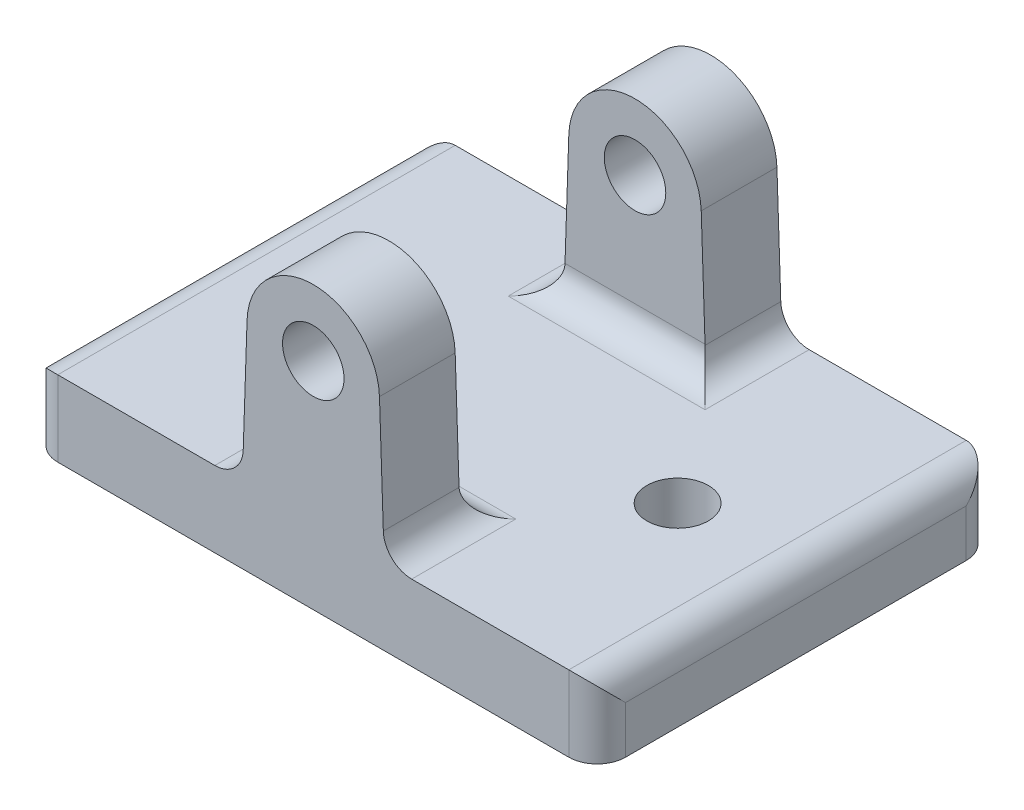
ISO-10303-21;
HEADER;
FILE_DESCRIPTION(('STEP AP214'),'2;1');
FILE_NAME('part.step','',(''),(''),'','','');
FILE_SCHEMA(('AUTOMOTIVE_DESIGN { 1 0 10303 214 1 1 1 1 }'));
ENDSEC;
DATA;
#1=APPLICATION_CONTEXT('core data for automotive mechanical design processes');
#2=APPLICATION_PROTOCOL_DEFINITION('international standard','automotive_design',2000,#1);
#3=PRODUCT_CONTEXT('',#1,'mechanical');
#4=PRODUCT('Part','Part','',(#3));
#5=PRODUCT_RELATED_PRODUCT_CATEGORY('part','',(#4));
#6=PRODUCT_DEFINITION_FORMATION('','',#4);
#7=PRODUCT_DEFINITION_CONTEXT('part definition',#1,'design');
#8=PRODUCT_DEFINITION('design','',#6,#7);
#9=PRODUCT_DEFINITION_SHAPE('','',#8);
#10=(LENGTH_UNIT() NAMED_UNIT(*) SI_UNIT(.MILLI.,.METRE.));
#11=(NAMED_UNIT(*) PLANE_ANGLE_UNIT() SI_UNIT($,.RADIAN.));
#12=(NAMED_UNIT(*) SI_UNIT($,.STERADIAN.) SOLID_ANGLE_UNIT());
#13=UNCERTAINTY_MEASURE_WITH_UNIT(LENGTH_MEASURE(1.E-05),#10,'distance_accuracy_value','');
#14=(GEOMETRIC_REPRESENTATION_CONTEXT(3) GLOBAL_UNCERTAINTY_ASSIGNED_CONTEXT((#13)) GLOBAL_UNIT_ASSIGNED_CONTEXT((#10,
#11,#12)) REPRESENTATION_CONTEXT('',''));
#15=CARTESIAN_POINT('',(0.,0.,0.));
#16=DIRECTION('',(0.,0.,1.));
#17=DIRECTION('',(1.,0.,0.));
#18=AXIS2_PLACEMENT_3D('',#15,#16,#17);
#19=CARTESIAN_POINT('',(0.,8.,0.));
#20=DIRECTION('',(0.,-1.,0.));
#21=DIRECTION('',(0.,0.,-1.));
#22=AXIS2_PLACEMENT_3D('',#19,#20,#21);
#23=PLANE('',#22);
#24=CARTESIAN_POINT('',(-17.5,8.,0.));
#25=DIRECTION('',(0.,1.,0.));
#26=DIRECTION('',(0.,0.,1.));
#27=AXIS2_PLACEMENT_3D('',#24,#25,#26);
#28=CIRCLE('',#27,3.24999999999999);
#29=CARTESIAN_POINT('',(-17.5,8.,3.24999999999999));
#30=VERTEX_POINT('',#29);
#31=EDGE_CURVE('E288',#30,#30,#28,.T.);
#32=ORIENTED_EDGE('',*,*,#31,.F.);
#33=EDGE_LOOP('',(#32));
#34=FACE_BOUND('',#33,.T.);
#35=CARTESIAN_POINT('',(17.5,8.,0.));
#36=DIRECTION('',(0.,1.,0.));
#37=DIRECTION('',(0.,0.,-1.));
#38=AXIS2_PLACEMENT_3D('',#35,#36,#37);
#39=CIRCLE('',#38,3.25);
#40=CARTESIAN_POINT('',(17.5,8.,-3.25));
#41=VERTEX_POINT('',#40);
#42=EDGE_CURVE('E280',#41,#41,#39,.T.);
#43=ORIENTED_EDGE('',*,*,#42,.F.);
#44=EDGE_LOOP('',(#43));
#45=FACE_BOUND('',#44,.T.);
#46=DIRECTION('',(1.,0.,0.));
#47=VECTOR('',#46,1.);
#48=CARTESIAN_POINT('',(-30.,8.,21.));
#49=LINE('',#48,#47);
#50=CARTESIAN_POINT('',(-27.,8.,21.));
#51=VERTEX_POINT('',#50);
#52=CARTESIAN_POINT('',(-10.4009031694853,8.,21.));
#53=VERTEX_POINT('',#52);
#54=EDGE_CURVE('E302',#51,#53,#49,.T.);
#55=ORIENTED_EDGE('',*,*,#54,.T.);
#56=DIRECTION('',(0.,0.,1.));
#57=VECTOR('',#56,1.);
#58=CARTESIAN_POINT('',(-10.4009031694853,8.,0.));
#59=LINE('',#58,#57);
#60=CARTESIAN_POINT('',(-10.4009031694853,8.,10.));
#61=VERTEX_POINT('',#60);
#62=EDGE_CURVE('E390',#53,#61,#59,.F.);
#63=ORIENTED_EDGE('',*,*,#62,.T.);
#64=DIRECTION('',(1.,0.,0.));
#65=VECTOR('',#64,1.);
#66=CARTESIAN_POINT('',(0.,8.,10.));
#67=LINE('',#66,#65);
#68=CARTESIAN_POINT('',(10.4009031694853,8.,10.));
#69=VERTEX_POINT('',#68);
#70=EDGE_CURVE('E386',#61,#69,#67,.T.);
#71=ORIENTED_EDGE('',*,*,#70,.T.);
#72=DIRECTION('',(0.,0.,1.));
#73=VECTOR('',#72,1.);
#74=CARTESIAN_POINT('',(10.4009031694853,8.,0.));
#75=LINE('',#74,#73);
#76=CARTESIAN_POINT('',(10.4009031694853,8.,21.));
#77=VERTEX_POINT('',#76);
#78=EDGE_CURVE('E383',#69,#77,#75,.T.);
#79=ORIENTED_EDGE('',*,*,#78,.T.);
#80=CARTESIAN_POINT('',(27.,8.,21.));
#81=VERTEX_POINT('',#80);
#82=EDGE_CURVE('E300',#77,#81,#49,.T.);
#83=ORIENTED_EDGE('',*,*,#82,.T.);
#84=DIRECTION('',(0.,0.,-1.));
#85=VECTOR('',#84,1.);
#86=CARTESIAN_POINT('',(27.,8.,0.));
#87=LINE('',#86,#85);
#88=CARTESIAN_POINT('',(27.,8.,-21.));
#89=VERTEX_POINT('',#88);
#90=EDGE_CURVE('E368',#81,#89,#87,.T.);
#91=ORIENTED_EDGE('',*,*,#90,.T.);
#92=DIRECTION('',(-1.,0.,0.));
#93=VECTOR('',#92,1.);
#94=CARTESIAN_POINT('',(-30.,8.,-21.));
#95=LINE('',#94,#93);
#96=CARTESIAN_POINT('',(10.4009031694853,8.,-21.));
#97=VERTEX_POINT('',#96);
#98=EDGE_CURVE('E296',#89,#97,#95,.T.);
#99=ORIENTED_EDGE('',*,*,#98,.T.);
#100=DIRECTION('',(0.,0.,-1.));
#101=VECTOR('',#100,1.);
#102=CARTESIAN_POINT('',(10.4009031694853,8.,-13.));
#103=LINE('',#102,#101);
#104=CARTESIAN_POINT('',(10.4009031694853,8.,-10.));
#105=VERTEX_POINT('',#104);
#106=EDGE_CURVE('E374',#97,#105,#103,.F.);
#107=ORIENTED_EDGE('',*,*,#106,.T.);
#108=DIRECTION('',(1.,0.,0.));
#109=VECTOR('',#108,1.);
#110=CARTESIAN_POINT('',(0.,8.,-10.));
#111=LINE('',#110,#109);
#112=CARTESIAN_POINT('',(-10.4009031694853,8.,-10.));
#113=VERTEX_POINT('',#112);
#114=EDGE_CURVE('E377',#105,#113,#111,.F.);
#115=ORIENTED_EDGE('',*,*,#114,.T.);
#116=DIRECTION('',(0.,0.,-1.));
#117=VECTOR('',#116,1.);
#118=CARTESIAN_POINT('',(-10.4009031694853,8.,-21.));
#119=LINE('',#118,#117);
#120=CARTESIAN_POINT('',(-10.4009031694853,8.,-21.));
#121=VERTEX_POINT('',#120);
#122=EDGE_CURVE('E380',#113,#121,#119,.T.);
#123=ORIENTED_EDGE('',*,*,#122,.T.);
#124=CARTESIAN_POINT('',(-27.,8.,-21.));
#125=VERTEX_POINT('',#124);
#126=EDGE_CURVE('E301',#121,#125,#95,.T.);
#127=ORIENTED_EDGE('',*,*,#126,.T.);
#128=DIRECTION('',(0.,0.,1.));
#129=VECTOR('',#128,1.);
#130=CARTESIAN_POINT('',(-27.,8.,0.));
#131=LINE('',#130,#129);
#132=EDGE_CURVE('E371',#125,#51,#131,.T.);
#133=ORIENTED_EDGE('',*,*,#132,.T.);
#134=EDGE_LOOP('',(#55,#63,#71,#79,#83,#91,#99,#107,#115,#123,#127,#133));
#135=FACE_BOUND('',#134,.T.);
#136=ADVANCED_FACE('F40',(#34,#45,#135),#23,.F.);
#137=CARTESIAN_POINT('',(0.,0.,0.));
#138=DIRECTION('',(0.,-1.,0.));
#139=DIRECTION('',(0.,0.,-1.));
#140=AXIS2_PLACEMENT_3D('',#137,#138,#139);
#141=PLANE('',#140);
#142=CARTESIAN_POINT('',(-17.5,0.,0.));
#143=DIRECTION('',(0.,1.,0.));
#144=DIRECTION('',(0.,0.,1.));
#145=AXIS2_PLACEMENT_3D('',#142,#143,#144);
#146=CIRCLE('',#145,3.24999999999999);
#147=CARTESIAN_POINT('',(-17.5,0.,3.24999999999999));
#148=VERTEX_POINT('',#147);
#149=EDGE_CURVE('E284',#148,#148,#146,.T.);
#150=ORIENTED_EDGE('',*,*,#149,.T.);
#151=EDGE_LOOP('',(#150));
#152=FACE_BOUND('',#151,.T.);
#153=DIRECTION('',(0.,0.,-1.));
#154=VECTOR('',#153,1.);
#155=CARTESIAN_POINT('',(30.,0.,21.));
#156=LINE('',#155,#154);
#157=CARTESIAN_POINT('',(30.,0.,18.));
#158=VERTEX_POINT('',#157);
#159=CARTESIAN_POINT('',(30.,0.,-18.));
#160=VERTEX_POINT('',#159);
#161=EDGE_CURVE('E292',#158,#160,#156,.T.);
#162=ORIENTED_EDGE('',*,*,#161,.F.);
#163=CARTESIAN_POINT('',(27.,0.,18.));
#164=DIRECTION('',(0.,-1.,0.));
#165=DIRECTION('',(0.,0.,-1.));
#166=AXIS2_PLACEMENT_3D('',#163,#164,#165);
#167=CIRCLE('',#166,3.);
#168=CARTESIAN_POINT('',(27.,0.,21.));
#169=VERTEX_POINT('',#168);
#170=EDGE_CURVE('E340',#158,#169,#167,.T.);
#171=ORIENTED_EDGE('',*,*,#170,.T.);
#172=DIRECTION('',(1.,0.,0.));
#173=VECTOR('',#172,1.);
#174=CARTESIAN_POINT('',(-30.,0.,21.));
#175=LINE('',#174,#173);
#176=CARTESIAN_POINT('',(-27.,0.,21.));
#177=VERTEX_POINT('',#176);
#178=EDGE_CURVE('E318',#177,#169,#175,.T.);
#179=ORIENTED_EDGE('',*,*,#178,.F.);
#180=CARTESIAN_POINT('',(-27.,0.,18.));
#181=DIRECTION('',(0.,-1.,0.));
#182=DIRECTION('',(0.,0.,-1.));
#183=AXIS2_PLACEMENT_3D('',#180,#181,#182);
#184=CIRCLE('',#183,3.);
#185=CARTESIAN_POINT('',(-30.,0.,18.));
#186=VERTEX_POINT('',#185);
#187=EDGE_CURVE('E337',#177,#186,#184,.T.);
#188=ORIENTED_EDGE('',*,*,#187,.T.);
#189=DIRECTION('',(0.,0.,1.));
#190=VECTOR('',#189,1.);
#191=CARTESIAN_POINT('',(-30.,0.,21.));
#192=LINE('',#191,#190);
#193=CARTESIAN_POINT('',(-30.,0.,-18.));
#194=VERTEX_POINT('',#193);
#195=EDGE_CURVE('E314',#194,#186,#192,.T.);
#196=ORIENTED_EDGE('',*,*,#195,.F.);
#197=CARTESIAN_POINT('',(-27.,0.,-18.));
#198=DIRECTION('',(0.,-1.,0.));
#199=DIRECTION('',(0.,0.,-1.));
#200=AXIS2_PLACEMENT_3D('',#197,#198,#199);
#201=CIRCLE('',#200,3.);
#202=CARTESIAN_POINT('',(-27.,0.,-21.));
#203=VERTEX_POINT('',#202);
#204=EDGE_CURVE('E334',#194,#203,#201,.T.);
#205=ORIENTED_EDGE('',*,*,#204,.T.);
#206=DIRECTION('',(-1.,0.,0.));
#207=VECTOR('',#206,1.);
#208=CARTESIAN_POINT('',(-30.,0.,-21.));
#209=LINE('',#208,#207);
#210=CARTESIAN_POINT('',(27.,0.,-21.));
#211=VERTEX_POINT('',#210);
#212=EDGE_CURVE('E310',#211,#203,#209,.T.);
#213=ORIENTED_EDGE('',*,*,#212,.F.);
#214=CARTESIAN_POINT('',(27.,0.,-18.));
#215=DIRECTION('',(0.,-1.,0.));
#216=DIRECTION('',(0.,0.,-1.));
#217=AXIS2_PLACEMENT_3D('',#214,#215,#216);
#218=CIRCLE('',#217,3.);
#219=EDGE_CURVE('E331',#211,#160,#218,.T.);
#220=ORIENTED_EDGE('',*,*,#219,.T.);
#221=EDGE_LOOP('',(#162,#171,#179,#188,#196,#205,#213,#220));
#222=FACE_BOUND('',#221,.T.);
#223=CARTESIAN_POINT('',(17.5,0.,0.));
#224=DIRECTION('',(0.,1.,0.));
#225=DIRECTION('',(0.,0.,-1.));
#226=AXIS2_PLACEMENT_3D('',#223,#224,#225);
#227=CIRCLE('',#226,3.25);
#228=CARTESIAN_POINT('',(17.5,0.,-3.25));
#229=VERTEX_POINT('',#228);
#230=EDGE_CURVE('E276',#229,#229,#227,.T.);
#231=ORIENTED_EDGE('',*,*,#230,.T.);
#232=EDGE_LOOP('',(#231));
#233=FACE_BOUND('',#232,.T.);
#234=ADVANCED_FACE('F479',(#152,#222,#233),#141,.T.);
#235=CARTESIAN_POINT('',(30.,8.,21.));
#236=DIRECTION('',(-1.,0.,0.));
#237=DIRECTION('',(0.,0.,1.));
#238=AXIS2_PLACEMENT_3D('',#235,#236,#237);
#239=PLANE('',#238);
#240=DIRECTION('',(0.,0.,-1.));
#241=VECTOR('',#240,1.);
#242=CARTESIAN_POINT('',(30.,5.,21.));
#243=LINE('',#242,#241);
#244=CARTESIAN_POINT('',(30.,5.,-18.));
#245=VERTEX_POINT('',#244);
#246=CARTESIAN_POINT('',(30.,5.,18.));
#247=VERTEX_POINT('',#246);
#248=EDGE_CURVE('E306',#245,#247,#243,.F.);
#249=ORIENTED_EDGE('',*,*,#248,.T.);
#250=DIRECTION('',(0.,-1.,0.));
#251=VECTOR('',#250,1.);
#252=CARTESIAN_POINT('',(30.,8.,18.));
#253=LINE('',#252,#251);
#254=EDGE_CURVE('E327',#247,#158,#253,.T.);
#255=ORIENTED_EDGE('',*,*,#254,.T.);
#256=ORIENTED_EDGE('',*,*,#161,.T.);
#257=DIRECTION('',(0.,-1.,0.));
#258=VECTOR('',#257,1.);
#259=CARTESIAN_POINT('',(30.,8.,-18.));
#260=LINE('',#259,#258);
#261=EDGE_CURVE('E324',#160,#245,#260,.F.);
#262=ORIENTED_EDGE('',*,*,#261,.T.);
#263=EDGE_LOOP('',(#249,#255,#256,#262));
#264=FACE_BOUND('',#263,.T.);
#265=ADVANCED_FACE('F508',(#264),#239,.F.);
#266=CARTESIAN_POINT('',(-30.,8.,-21.));
#267=DIRECTION('',(0.,0.,1.));
#268=DIRECTION('',(1.,0.,0.));
#269=AXIS2_PLACEMENT_3D('',#266,#267,#268);
#270=PLANE('',#269);
#271=ORIENTED_EDGE('',*,*,#212,.T.);
#272=DIRECTION('',(0.,-1.,0.));
#273=VECTOR('',#272,1.);
#274=CARTESIAN_POINT('',(-27.,8.,-21.));
#275=LINE('',#274,#273);
#276=EDGE_CURVE('E362',#203,#125,#275,.F.);
#277=ORIENTED_EDGE('',*,*,#276,.T.);
#278=ORIENTED_EDGE('',*,*,#126,.F.);
#279=CARTESIAN_POINT('',(-10.4009031694853,11.,-21.));
#280=DIRECTION('',(0.,0.,1.));
#281=DIRECTION('',(1.,0.,0.));
#282=AXIS2_PLACEMENT_3D('',#279,#280,#281);
#283=CIRCLE('',#282,3.);
#284=CARTESIAN_POINT('',(-7.40259482270454,10.8992673954235,-21.));
#285=VERTEX_POINT('',#284);
#286=EDGE_CURVE('E50',#121,#285,#283,.T.);
#287=ORIENTED_EDGE('',*,*,#286,.T.);
#288=DIRECTION('',(-0.0335775348588195,-0.99943611559359,0.));
#289=VECTOR('',#288,1.);
#290=CARTESIAN_POINT('',(-7.49999999999999,8.,-21.));
#291=LINE('',#290,#289);
#292=CARTESIAN_POINT('',(-6.99605280915513,23.,-21.));
#293=VERTEX_POINT('',#292);
#294=EDGE_CURVE('E235',#293,#285,#291,.T.);
#295=ORIENTED_EDGE('',*,*,#294,.F.);
#296=CARTESIAN_POINT('',(0.,22.7649572559883,-21.));
#297=DIRECTION('',(0.,0.,1.));
#298=DIRECTION('',(-1.,0.,0.));
#299=AXIS2_PLACEMENT_3D('',#296,#297,#298);
#300=CIRCLE('',#299,7.);
#301=CARTESIAN_POINT('',(6.99605280915514,23.,-21.));
#302=VERTEX_POINT('',#301);
#303=EDGE_CURVE('E212',#302,#293,#300,.T.);
#304=ORIENTED_EDGE('',*,*,#303,.F.);
#305=DIRECTION('',(-0.0335775348588197,0.99943611559359,0.));
#306=VECTOR('',#305,1.);
#307=CARTESIAN_POINT('',(6.99605280915514,23.,-21.));
#308=LINE('',#307,#306);
#309=CARTESIAN_POINT('',(7.40259482270455,10.8992673954235,-21.));
#310=VERTEX_POINT('',#309);
#311=EDGE_CURVE('E223',#310,#302,#308,.T.);
#312=ORIENTED_EDGE('',*,*,#311,.F.);
#313=CARTESIAN_POINT('',(10.4009031694853,11.,-21.));
#314=DIRECTION('',(0.,0.,1.));
#315=DIRECTION('',(1.,0.,0.));
#316=AXIS2_PLACEMENT_3D('',#313,#314,#315);
#317=CIRCLE('',#316,3.);
#318=EDGE_CURVE('E11',#310,#97,#317,.T.);
#319=ORIENTED_EDGE('',*,*,#318,.T.);
#320=ORIENTED_EDGE('',*,*,#98,.F.);
#321=DIRECTION('',(0.,-1.,0.));
#322=VECTOR('',#321,1.);
#323=CARTESIAN_POINT('',(27.,8.,-21.));
#324=LINE('',#323,#322);
#325=EDGE_CURVE('E359',#89,#211,#324,.T.);
#326=ORIENTED_EDGE('',*,*,#325,.T.);
#327=EDGE_LOOP('',(#271,#277,#278,#287,#295,#304,#312,#319,#320,#326));
#328=FACE_BOUND('',#327,.T.);
#329=CARTESIAN_POINT('',(0.,22.7649572559883,-21.));
#330=DIRECTION('',(0.,0.,1.));
#331=DIRECTION('',(1.,0.,0.));
#332=AXIS2_PLACEMENT_3D('',#329,#330,#331);
#333=CIRCLE('',#332,3.25);
#334=CARTESIAN_POINT('',(3.25000000000001,22.7649572559883,-21.));
#335=VERTEX_POINT('',#334);
#336=EDGE_CURVE('E230',#335,#335,#333,.T.);
#337=ORIENTED_EDGE('',*,*,#336,.T.);
#338=EDGE_LOOP('',(#337));
#339=FACE_BOUND('',#338,.T.);
#340=ADVANCED_FACE('F492',(#328,#339),#270,.F.);
#341=CARTESIAN_POINT('',(-30.,8.,21.));
#342=DIRECTION('',(1.,0.,0.));
#343=DIRECTION('',(0.,0.,-1.));
#344=AXIS2_PLACEMENT_3D('',#341,#342,#343);
#345=PLANE('',#344);
#346=ORIENTED_EDGE('',*,*,#195,.T.);
#347=DIRECTION('',(0.,-1.,0.));
#348=VECTOR('',#347,1.);
#349=CARTESIAN_POINT('',(-30.,8.,18.));
#350=LINE('',#349,#348);
#351=CARTESIAN_POINT('',(-30.,5.,18.));
#352=VERTEX_POINT('',#351);
#353=EDGE_CURVE('E356',#186,#352,#350,.F.);
#354=ORIENTED_EDGE('',*,*,#353,.T.);
#355=DIRECTION('',(0.,0.,1.));
#356=VECTOR('',#355,1.);
#357=CARTESIAN_POINT('',(-30.,5.,21.));
#358=LINE('',#357,#356);
#359=CARTESIAN_POINT('',(-30.,5.,-18.));
#360=VERTEX_POINT('',#359);
#361=EDGE_CURVE('E350',#352,#360,#358,.F.);
#362=ORIENTED_EDGE('',*,*,#361,.T.);
#363=DIRECTION('',(0.,-1.,0.));
#364=VECTOR('',#363,1.);
#365=CARTESIAN_POINT('',(-30.,8.,-18.));
#366=LINE('',#365,#364);
#367=EDGE_CURVE('E353',#360,#194,#366,.T.);
#368=ORIENTED_EDGE('',*,*,#367,.T.);
#369=EDGE_LOOP('',(#346,#354,#362,#368));
#370=FACE_BOUND('',#369,.T.);
#371=ADVANCED_FACE('F483',(#370),#345,.F.);
#372=CARTESIAN_POINT('',(-30.,8.,21.));
#373=DIRECTION('',(0.,0.,-1.));
#374=DIRECTION('',(-1.,0.,0.));
#375=AXIS2_PLACEMENT_3D('',#372,#373,#374);
#376=PLANE('',#375);
#377=ORIENTED_EDGE('',*,*,#178,.T.);
#378=DIRECTION('',(0.,-1.,0.));
#379=VECTOR('',#378,1.);
#380=CARTESIAN_POINT('',(27.,8.,21.));
#381=LINE('',#380,#379);
#382=EDGE_CURVE('E347',#169,#81,#381,.F.);
#383=ORIENTED_EDGE('',*,*,#382,.T.);
#384=ORIENTED_EDGE('',*,*,#82,.F.);
#385=CARTESIAN_POINT('',(10.4009031694853,11.,21.));
#386=DIRECTION('',(0.,0.,-1.));
#387=DIRECTION('',(-1.,0.,0.));
#388=AXIS2_PLACEMENT_3D('',#385,#386,#387);
#389=CIRCLE('',#388,3.);
#390=CARTESIAN_POINT('',(7.40259482270455,10.8992673954235,21.));
#391=VERTEX_POINT('',#390);
#392=EDGE_CURVE('E421',#77,#391,#389,.T.);
#393=ORIENTED_EDGE('',*,*,#392,.T.);
#394=DIRECTION('',(-0.0335775348588197,0.99943611559359,0.));
#395=VECTOR('',#394,1.);
#396=CARTESIAN_POINT('',(6.99605280915514,23.,21.));
#397=LINE('',#396,#395);
#398=CARTESIAN_POINT('',(6.99605280915514,23.,21.));
#399=VERTEX_POINT('',#398);
#400=EDGE_CURVE('E248',#391,#399,#397,.T.);
#401=ORIENTED_EDGE('',*,*,#400,.T.);
#402=CARTESIAN_POINT('',(0.,22.7649572559883,21.));
#403=DIRECTION('',(0.,0.,1.));
#404=DIRECTION('',(-1.,0.,0.));
#405=AXIS2_PLACEMENT_3D('',#402,#403,#404);
#406=CIRCLE('',#405,7.);
#407=CARTESIAN_POINT('',(-6.99605280915513,23.,21.));
#408=VERTEX_POINT('',#407);
#409=EDGE_CURVE('E266',#399,#408,#406,.T.);
#410=ORIENTED_EDGE('',*,*,#409,.T.);
#411=DIRECTION('',(-0.0335775348588195,-0.99943611559359,0.));
#412=VECTOR('',#411,1.);
#413=CARTESIAN_POINT('',(-7.49999999999999,8.,21.));
#414=LINE('',#413,#412);
#415=CARTESIAN_POINT('',(-7.40259482270454,10.8992673954235,21.));
#416=VERTEX_POINT('',#415);
#417=EDGE_CURVE('E255',#408,#416,#414,.T.);
#418=ORIENTED_EDGE('',*,*,#417,.T.);
#419=CARTESIAN_POINT('',(-10.4009031694853,11.,21.));
#420=DIRECTION('',(0.,0.,-1.));
#421=DIRECTION('',(-1.,0.,0.));
#422=AXIS2_PLACEMENT_3D('',#419,#420,#421);
#423=CIRCLE('',#422,3.);
#424=EDGE_CURVE('E418',#416,#53,#423,.T.);
#425=ORIENTED_EDGE('',*,*,#424,.T.);
#426=ORIENTED_EDGE('',*,*,#54,.F.);
#427=DIRECTION('',(0.,-1.,0.));
#428=VECTOR('',#427,1.);
#429=CARTESIAN_POINT('',(-27.,8.,21.));
#430=LINE('',#429,#428);
#431=EDGE_CURVE('E343',#51,#177,#430,.T.);
#432=ORIENTED_EDGE('',*,*,#431,.T.);
#433=EDGE_LOOP('',(#377,#383,#384,#393,#401,#410,#418,#425,#426,#432));
#434=FACE_BOUND('',#433,.T.);
#435=CARTESIAN_POINT('',(0.,22.7649572559883,21.));
#436=DIRECTION('',(0.,0.,1.));
#437=DIRECTION('',(1.,0.,0.));
#438=AXIS2_PLACEMENT_3D('',#435,#436,#437);
#439=CIRCLE('',#438,3.25);
#440=CARTESIAN_POINT('',(3.25000000000001,22.7649572559883,21.));
#441=VERTEX_POINT('',#440);
#442=EDGE_CURVE('E242',#441,#441,#439,.T.);
#443=ORIENTED_EDGE('',*,*,#442,.F.);
#444=EDGE_LOOP('',(#443));
#445=FACE_BOUND('',#444,.T.);
#446=ADVANCED_FACE('F466',(#434,#445),#376,.F.);
#447=CARTESIAN_POINT('',(-17.5,8.,0.));
#448=DIRECTION('',(0.,-1.,0.));
#449=DIRECTION('',(0.,0.,-1.));
#450=AXIS2_PLACEMENT_3D('',#447,#448,#449);
#451=CYLINDRICAL_SURFACE('',#450,3.24999999999999);
#452=ORIENTED_EDGE('',*,*,#31,.T.);
#453=EDGE_LOOP('',(#452));
#454=FACE_BOUND('',#453,.T.);
#455=ORIENTED_EDGE('',*,*,#149,.F.);
#456=EDGE_LOOP('',(#455));
#457=FACE_BOUND('',#456,.T.);
#458=ADVANCED_FACE('F534',(#454,#457),#451,.F.);
#459=CARTESIAN_POINT('',(17.5,8.,0.));
#460=DIRECTION('',(0.,-1.,0.));
#461=DIRECTION('',(0.,0.,-1.));
#462=AXIS2_PLACEMENT_3D('',#459,#460,#461);
#463=CYLINDRICAL_SURFACE('',#462,3.25);
#464=ORIENTED_EDGE('',*,*,#42,.T.);
#465=EDGE_LOOP('',(#464));
#466=FACE_BOUND('',#465,.T.);
#467=ORIENTED_EDGE('',*,*,#230,.F.);
#468=EDGE_LOOP('',(#467));
#469=FACE_BOUND('',#468,.T.);
#470=ADVANCED_FACE('F561',(#466,#469),#463,.F.);
#471=CARTESIAN_POINT('',(-7.49999999999999,8.,13.));
#472=DIRECTION('',(-0.99943611559359,0.0335775348588195,0.));
#473=DIRECTION('',(-0.0335775348588195,-0.99943611559359,0.));
#474=AXIS2_PLACEMENT_3D('',#471,#472,#473);
#475=PLANE('',#474);
#476=CARTESIAN_POINT('',(-7.39921056183102,11.,10.));
#477=DIRECTION('',(-0.99943611559359,0.0335775348588195,0.));
#478=DIRECTION('',(0.0335775348588195,0.99943611559359,0.));
#479=AXIS2_PLACEMENT_3D('',#476,#477,#478);
#480=ELLIPSE('',#479,3.00169260765429,3.);
#481=CARTESIAN_POINT('',(-7.39921056183102,11.,13.));
#482=VERTEX_POINT('',#481);
#483=CARTESIAN_POINT('',(-7.40259482270454,10.8992673954235,12.9983083467808));
#484=VERTEX_POINT('',#483);
#485=EDGE_CURVE('E415',#482,#484,#480,.F.);
#486=ORIENTED_EDGE('',*,*,#485,.T.);
#487=DIRECTION('',(0.,0.,1.));
#488=VECTOR('',#487,1.);
#489=CARTESIAN_POINT('',(-7.40259482270454,10.8992673954235,13.));
#490=LINE('',#489,#488);
#491=EDGE_CURVE('E58',#484,#416,#490,.T.);
#492=ORIENTED_EDGE('',*,*,#491,.T.);
#493=ORIENTED_EDGE('',*,*,#417,.F.);
#494=DIRECTION('',(0.,0.,1.));
#495=VECTOR('',#494,1.);
#496=CARTESIAN_POINT('',(-6.99605280915513,23.,13.));
#497=LINE('',#496,#495);
#498=CARTESIAN_POINT('',(-6.99605280915513,23.,13.));
#499=VERTEX_POINT('',#498);
#500=EDGE_CURVE('E273',#499,#408,#497,.T.);
#501=ORIENTED_EDGE('',*,*,#500,.F.);
#502=DIRECTION('',(-0.0335775348588195,-0.99943611559359,0.));
#503=VECTOR('',#502,1.);
#504=CARTESIAN_POINT('',(-7.49999999999999,8.,13.));
#505=LINE('',#504,#503);
#506=EDGE_CURVE('E259',#499,#482,#505,.T.);
#507=ORIENTED_EDGE('',*,*,#506,.T.);
#508=EDGE_LOOP('',(#486,#492,#493,#501,#507));
#509=FACE_BOUND('',#508,.T.);
#510=ADVANCED_FACE('F567',(#509),#475,.T.);
#511=CARTESIAN_POINT('',(0.,22.7649572559883,13.));
#512=DIRECTION('',(0.,0.,1.));
#513=DIRECTION('',(1.,0.,0.));
#514=AXIS2_PLACEMENT_3D('',#511,#512,#513);
#515=CYLINDRICAL_SURFACE('',#514,7.);
#516=ORIENTED_EDGE('',*,*,#409,.F.);
#517=DIRECTION('',(0.,0.,1.));
#518=VECTOR('',#517,1.);
#519=CARTESIAN_POINT('',(6.99605280915514,23.,13.));
#520=LINE('',#519,#518);
#521=CARTESIAN_POINT('',(6.99605280915514,23.,13.));
#522=VERTEX_POINT('',#521);
#523=EDGE_CURVE('E263',#522,#399,#520,.T.);
#524=ORIENTED_EDGE('',*,*,#523,.F.);
#525=CARTESIAN_POINT('',(0.,22.7649572559883,13.));
#526=DIRECTION('',(0.,0.,1.));
#527=DIRECTION('',(-1.,0.,0.));
#528=AXIS2_PLACEMENT_3D('',#525,#526,#527);
#529=CIRCLE('',#528,7.);
#530=EDGE_CURVE('E254',#522,#499,#529,.T.);
#531=ORIENTED_EDGE('',*,*,#530,.T.);
#532=ORIENTED_EDGE('',*,*,#500,.T.);
#533=EDGE_LOOP('',(#516,#524,#531,#532));
#534=FACE_BOUND('',#533,.T.);
#535=ADVANCED_FACE('F573',(#534),#515,.T.);
#536=CARTESIAN_POINT('',(6.99605280915514,23.,13.));
#537=DIRECTION('',(0.99943611559359,0.0335775348588197,0.));
#538=DIRECTION('',(-0.0335775348588197,0.99943611559359,0.));
#539=AXIS2_PLACEMENT_3D('',#536,#537,#538);
#540=PLANE('',#539);
#541=ORIENTED_EDGE('',*,*,#400,.F.);
#542=DIRECTION('',(0.,0.,1.));
#543=VECTOR('',#542,1.);
#544=CARTESIAN_POINT('',(7.40259482270455,10.8992673954235,13.));
#545=LINE('',#544,#543);
#546=CARTESIAN_POINT('',(7.40259482270455,10.8992673954235,12.9983083467808));
#547=VERTEX_POINT('',#546);
#548=EDGE_CURVE('E66',#391,#547,#545,.F.);
#549=ORIENTED_EDGE('',*,*,#548,.T.);
#550=CARTESIAN_POINT('',(7.39921056183104,11.,10.));
#551=DIRECTION('',(0.99943611559359,0.0335775348588197,0.));
#552=DIRECTION('',(0.0335775348588197,-0.99943611559359,0.));
#553=AXIS2_PLACEMENT_3D('',#550,#551,#552);
#554=ELLIPSE('',#553,3.00169260765429,3.);
#555=CARTESIAN_POINT('',(7.39921056183104,11.,13.));
#556=VERTEX_POINT('',#555);
#557=EDGE_CURVE('E412',#547,#556,#554,.F.);
#558=ORIENTED_EDGE('',*,*,#557,.T.);
#559=DIRECTION('',(-0.0335775348588197,0.99943611559359,0.));
#560=VECTOR('',#559,1.);
#561=CARTESIAN_POINT('',(6.99605280915514,23.,13.));
#562=LINE('',#561,#560);
#563=EDGE_CURVE('E251',#556,#522,#562,.T.);
#564=ORIENTED_EDGE('',*,*,#563,.T.);
#565=ORIENTED_EDGE('',*,*,#523,.T.);
#566=EDGE_LOOP('',(#541,#549,#558,#564,#565));
#567=FACE_BOUND('',#566,.T.);
#568=ADVANCED_FACE('F580',(#567),#540,.T.);
#569=CARTESIAN_POINT('',(0.,22.7649572559883,13.));
#570=DIRECTION('',(0.,0.,-1.));
#571=DIRECTION('',(-1.,0.,0.));
#572=AXIS2_PLACEMENT_3D('',#569,#570,#571);
#573=PLANE('',#572);
#574=CARTESIAN_POINT('',(0.,22.7649572559883,13.));
#575=DIRECTION('',(0.,0.,1.));
#576=DIRECTION('',(1.,0.,0.));
#577=AXIS2_PLACEMENT_3D('',#574,#575,#576);
#578=CIRCLE('',#577,3.25);
#579=CARTESIAN_POINT('',(3.25000000000001,22.7649572559883,13.));
#580=VERTEX_POINT('',#579);
#581=EDGE_CURVE('E244',#580,#580,#578,.T.);
#582=ORIENTED_EDGE('',*,*,#581,.T.);
#583=EDGE_LOOP('',(#582));
#584=FACE_BOUND('',#583,.T.);
#585=ORIENTED_EDGE('',*,*,#563,.F.);
#586=DIRECTION('',(1.,0.,0.));
#587=VECTOR('',#586,1.);
#588=CARTESIAN_POINT('',(0.,11.,13.));
#589=LINE('',#588,#587);
#590=EDGE_CURVE('E393',#556,#482,#589,.F.);
#591=ORIENTED_EDGE('',*,*,#590,.T.);
#592=ORIENTED_EDGE('',*,*,#506,.F.);
#593=ORIENTED_EDGE('',*,*,#530,.F.);
#594=EDGE_LOOP('',(#585,#591,#592,#593));
#595=FACE_BOUND('',#594,.T.);
#596=ADVANCED_FACE('F587',(#584,#595),#573,.T.);
#597=CARTESIAN_POINT('',(0.,22.7649572559883,13.));
#598=DIRECTION('',(0.,0.,1.));
#599=DIRECTION('',(1.,0.,0.));
#600=AXIS2_PLACEMENT_3D('',#597,#598,#599);
#601=CYLINDRICAL_SURFACE('',#600,3.25);
#602=ORIENTED_EDGE('',*,*,#581,.F.);
#603=EDGE_LOOP('',(#602));
#604=FACE_BOUND('',#603,.T.);
#605=ORIENTED_EDGE('',*,*,#442,.T.);
#606=EDGE_LOOP('',(#605));
#607=FACE_BOUND('',#606,.T.);
#608=ADVANCED_FACE('F593',(#604,#607),#601,.F.);
#609=CARTESIAN_POINT('',(0.,22.7649572559883,-13.));
#610=DIRECTION('',(0.,0.,1.));
#611=DIRECTION('',(-1.,0.,0.));
#612=AXIS2_PLACEMENT_3D('',#609,#610,#611);
#613=PLANE('',#612);
#614=DIRECTION('',(-0.0335775348588195,-0.99943611559359,0.));
#615=VECTOR('',#614,1.);
#616=CARTESIAN_POINT('',(-7.49999999999999,8.,-13.));
#617=LINE('',#616,#615);
#618=CARTESIAN_POINT('',(-6.99605280915513,23.,-13.));
#619=VERTEX_POINT('',#618);
#620=CARTESIAN_POINT('',(-7.39921056183102,11.,-13.));
#621=VERTEX_POINT('',#620);
#622=EDGE_CURVE('E199',#619,#621,#617,.T.);
#623=ORIENTED_EDGE('',*,*,#622,.T.);
#624=DIRECTION('',(1.,0.,0.));
#625=VECTOR('',#624,1.);
#626=CARTESIAN_POINT('',(0.,11.,-13.));
#627=LINE('',#626,#625);
#628=CARTESIAN_POINT('',(7.39921056183104,11.,-13.));
#629=VERTEX_POINT('',#628);
#630=EDGE_CURVE('E365',#621,#629,#627,.T.);
#631=ORIENTED_EDGE('',*,*,#630,.T.);
#632=DIRECTION('',(-0.0335775348588197,0.99943611559359,0.));
#633=VECTOR('',#632,1.);
#634=CARTESIAN_POINT('',(6.99605280915514,23.,-13.));
#635=LINE('',#634,#633);
#636=CARTESIAN_POINT('',(6.99605280915514,23.,-13.));
#637=VERTEX_POINT('',#636);
#638=EDGE_CURVE('E202',#629,#637,#635,.T.);
#639=ORIENTED_EDGE('',*,*,#638,.T.);
#640=CARTESIAN_POINT('',(0.,22.7649572559883,-13.));
#641=DIRECTION('',(0.,0.,1.));
#642=DIRECTION('',(-1.,0.,0.));
#643=AXIS2_PLACEMENT_3D('',#640,#641,#642);
#644=CIRCLE('',#643,7.);
#645=EDGE_CURVE('E193',#637,#619,#644,.T.);
#646=ORIENTED_EDGE('',*,*,#645,.T.);
#647=EDGE_LOOP('',(#623,#631,#639,#646));
#648=FACE_BOUND('',#647,.T.);
#649=CARTESIAN_POINT('',(0.,22.7649572559883,-13.));
#650=DIRECTION('',(0.,0.,1.));
#651=DIRECTION('',(1.,0.,0.));
#652=AXIS2_PLACEMENT_3D('',#649,#650,#651);
#653=CIRCLE('',#652,3.25);
#654=CARTESIAN_POINT('',(3.25000000000001,22.7649572559883,-13.));
#655=VERTEX_POINT('',#654);
#656=EDGE_CURVE('E238',#655,#655,#653,.T.);
#657=ORIENTED_EDGE('',*,*,#656,.F.);
#658=EDGE_LOOP('',(#657));
#659=FACE_BOUND('',#658,.T.);
#660=ADVANCED_FACE('F195',(#648,#659),#613,.T.);
#661=CARTESIAN_POINT('',(6.99605280915514,23.,-13.));
#662=DIRECTION('',(-0.99943611559359,-0.0335775348588197,0.));
#663=DIRECTION('',(0.0335775348588197,-0.99943611559359,0.));
#664=AXIS2_PLACEMENT_3D('',#661,#662,#663);
#665=PLANE('',#664);
#666=CARTESIAN_POINT('',(7.39921056183104,11.,-10.));
#667=DIRECTION('',(-0.99943611559359,-0.0335775348588197,0.));
#668=DIRECTION('',(0.0335775348588197,-0.99943611559359,0.));
#669=AXIS2_PLACEMENT_3D('',#666,#667,#668);
#670=ELLIPSE('',#669,3.00169260765429,3.);
#671=CARTESIAN_POINT('',(7.40259482270455,10.8992673954235,-12.9983083467808));
#672=VERTEX_POINT('',#671);
#673=EDGE_CURVE('E406',#629,#672,#670,.T.);
#674=ORIENTED_EDGE('',*,*,#673,.T.);
#675=DIRECTION('',(0.,0.,-1.));
#676=VECTOR('',#675,1.);
#677=CARTESIAN_POINT('',(7.40259482270455,10.8992673954235,-21.));
#678=LINE('',#677,#676);
#679=EDGE_CURVE('E403',#672,#310,#678,.T.);
#680=ORIENTED_EDGE('',*,*,#679,.T.);
#681=ORIENTED_EDGE('',*,*,#311,.T.);
#682=DIRECTION('',(0.,0.,-1.));
#683=VECTOR('',#682,1.);
#684=CARTESIAN_POINT('',(6.99605280915514,23.,-13.));
#685=LINE('',#684,#683);
#686=EDGE_CURVE('E217',#637,#302,#685,.T.);
#687=ORIENTED_EDGE('',*,*,#686,.F.);
#688=ORIENTED_EDGE('',*,*,#638,.F.);
#689=EDGE_LOOP('',(#674,#680,#681,#687,#688));
#690=FACE_BOUND('',#689,.T.);
#691=ADVANCED_FACE('F606',(#690),#665,.F.);
#692=CARTESIAN_POINT('',(0.,22.7649572559883,-13.));
#693=DIRECTION('',(0.,0.,-1.));
#694=DIRECTION('',(-1.,0.,0.));
#695=AXIS2_PLACEMENT_3D('',#692,#693,#694);
#696=CYLINDRICAL_SURFACE('',#695,7.);
#697=ORIENTED_EDGE('',*,*,#303,.T.);
#698=DIRECTION('',(0.,0.,-1.));
#699=VECTOR('',#698,1.);
#700=CARTESIAN_POINT('',(-6.99605280915513,23.,-13.));
#701=LINE('',#700,#699);
#702=EDGE_CURVE('E209',#619,#293,#701,.T.);
#703=ORIENTED_EDGE('',*,*,#702,.F.);
#704=ORIENTED_EDGE('',*,*,#645,.F.);
#705=ORIENTED_EDGE('',*,*,#686,.T.);
#706=EDGE_LOOP('',(#697,#703,#704,#705));
#707=FACE_BOUND('',#706,.T.);
#708=ADVANCED_FACE('F210',(#707),#696,.T.);
#709=CARTESIAN_POINT('',(-7.49999999999999,8.,-13.));
#710=DIRECTION('',(0.99943611559359,-0.0335775348588195,0.));
#711=DIRECTION('',(0.0335775348588195,0.99943611559359,0.));
#712=AXIS2_PLACEMENT_3D('',#709,#710,#711);
#713=PLANE('',#712);
#714=ORIENTED_EDGE('',*,*,#294,.T.);
#715=DIRECTION('',(0.,0.,-1.));
#716=VECTOR('',#715,1.);
#717=CARTESIAN_POINT('',(-7.40259482270454,10.8992673954235,-13.));
#718=LINE('',#717,#716);
#719=CARTESIAN_POINT('',(-7.40259482270454,10.8992673954235,-12.9983083467808));
#720=VERTEX_POINT('',#719);
#721=EDGE_CURVE('E400',#285,#720,#718,.F.);
#722=ORIENTED_EDGE('',*,*,#721,.T.);
#723=CARTESIAN_POINT('',(-7.39921056183102,11.,-10.));
#724=DIRECTION('',(0.99943611559359,-0.0335775348588195,0.));
#725=DIRECTION('',(0.0335775348588195,0.99943611559359,0.));
#726=AXIS2_PLACEMENT_3D('',#723,#724,#725);
#727=ELLIPSE('',#726,3.00169260765429,3.);
#728=EDGE_CURVE('E221',#720,#621,#727,.T.);
#729=ORIENTED_EDGE('',*,*,#728,.T.);
#730=ORIENTED_EDGE('',*,*,#622,.F.);
#731=ORIENTED_EDGE('',*,*,#702,.T.);
#732=EDGE_LOOP('',(#714,#722,#729,#730,#731));
#733=FACE_BOUND('',#732,.T.);
#734=ADVANCED_FACE('F219',(#733),#713,.F.);
#735=CARTESIAN_POINT('',(0.,22.7649572559883,-13.));
#736=DIRECTION('',(0.,0.,-1.));
#737=DIRECTION('',(-1.,0.,0.));
#738=AXIS2_PLACEMENT_3D('',#735,#736,#737);
#739=CYLINDRICAL_SURFACE('',#738,3.25);
#740=ORIENTED_EDGE('',*,*,#656,.T.);
#741=EDGE_LOOP('',(#740));
#742=FACE_BOUND('',#741,.T.);
#743=ORIENTED_EDGE('',*,*,#336,.F.);
#744=EDGE_LOOP('',(#743));
#745=FACE_BOUND('',#744,.T.);
#746=ADVANCED_FACE('F623',(#742,#745),#739,.F.);
#747=CARTESIAN_POINT('',(27.,8.,-18.));
#748=DIRECTION('',(0.,-1.,0.));
#749=DIRECTION('',(0.,0.,-1.));
#750=AXIS2_PLACEMENT_3D('',#747,#748,#749);
#751=CYLINDRICAL_SURFACE('',#750,3.);
#752=ORIENTED_EDGE('',*,*,#219,.F.);
#753=ORIENTED_EDGE('',*,*,#325,.F.);
#754=CARTESIAN_POINT('',(27.,5.,-18.));
#755=DIRECTION('',(0.,-0.707106781186547,-0.707106781186547));
#756=DIRECTION('',(0.,0.707106781186547,-0.707106781186547));
#757=AXIS2_PLACEMENT_3D('',#754,#755,#756);
#758=ELLIPSE('',#757,4.24264068711928,3.);
#759=EDGE_CURVE('E430',#245,#89,#758,.F.);
#760=ORIENTED_EDGE('',*,*,#759,.F.);
#761=ORIENTED_EDGE('',*,*,#261,.F.);
#762=EDGE_LOOP('',(#752,#753,#760,#761));
#763=FACE_BOUND('',#762,.T.);
#764=ADVANCED_FACE('F499',(#763),#751,.T.);
#765=CARTESIAN_POINT('',(27.,5.,0.));
#766=DIRECTION('',(0.,0.,-1.));
#767=DIRECTION('',(-1.,0.,0.));
#768=AXIS2_PLACEMENT_3D('',#765,#766,#767);
#769=CYLINDRICAL_SURFACE('',#768,3.);
#770=ORIENTED_EDGE('',*,*,#759,.T.);
#771=ORIENTED_EDGE('',*,*,#90,.F.);
#772=CARTESIAN_POINT('',(27.,5.,18.));
#773=DIRECTION('',(0.,0.707106781186547,-0.707106781186547));
#774=DIRECTION('',(0.,-0.707106781186547,-0.707106781186547));
#775=AXIS2_PLACEMENT_3D('',#772,#773,#774);
#776=ELLIPSE('',#775,4.24264068711928,3.);
#777=EDGE_CURVE('E426',#247,#81,#776,.F.);
#778=ORIENTED_EDGE('',*,*,#777,.F.);
#779=ORIENTED_EDGE('',*,*,#248,.F.);
#780=EDGE_LOOP('',(#770,#771,#778,#779));
#781=FACE_BOUND('',#780,.T.);
#782=ADVANCED_FACE('F504',(#781),#769,.T.);
#783=CARTESIAN_POINT('',(27.,8.,18.));
#784=DIRECTION('',(0.,-1.,0.));
#785=DIRECTION('',(0.,0.,-1.));
#786=AXIS2_PLACEMENT_3D('',#783,#784,#785);
#787=CYLINDRICAL_SURFACE('',#786,3.);
#788=ORIENTED_EDGE('',*,*,#777,.T.);
#789=ORIENTED_EDGE('',*,*,#382,.F.);
#790=ORIENTED_EDGE('',*,*,#170,.F.);
#791=ORIENTED_EDGE('',*,*,#254,.F.);
#792=EDGE_LOOP('',(#788,#789,#790,#791));
#793=FACE_BOUND('',#792,.T.);
#794=ADVANCED_FACE('F513',(#793),#787,.T.);
#795=CARTESIAN_POINT('',(-27.,8.,-18.));
#796=DIRECTION('',(0.,-1.,0.));
#797=DIRECTION('',(0.,0.,-1.));
#798=AXIS2_PLACEMENT_3D('',#795,#796,#797);
#799=CYLINDRICAL_SURFACE('',#798,3.);
#800=ORIENTED_EDGE('',*,*,#204,.F.);
#801=ORIENTED_EDGE('',*,*,#367,.F.);
#802=CARTESIAN_POINT('',(-27.,5.,-18.));
#803=DIRECTION('',(0.,0.707106781186547,0.707106781186547));
#804=DIRECTION('',(0.,-0.707106781186547,0.707106781186547));
#805=AXIS2_PLACEMENT_3D('',#802,#803,#804);
#806=ELLIPSE('',#805,4.24264068711928,3.);
#807=EDGE_CURVE('E431',#125,#360,#806,.T.);
#808=ORIENTED_EDGE('',*,*,#807,.F.);
#809=ORIENTED_EDGE('',*,*,#276,.F.);
#810=EDGE_LOOP('',(#800,#801,#808,#809));
#811=FACE_BOUND('',#810,.T.);
#812=ADVANCED_FACE('F487',(#811),#799,.T.);
#813=CARTESIAN_POINT('',(-27.,5.,0.));
#814=DIRECTION('',(0.,0.,1.));
#815=DIRECTION('',(1.,0.,0.));
#816=AXIS2_PLACEMENT_3D('',#813,#814,#815);
#817=CYLINDRICAL_SURFACE('',#816,3.);
#818=ORIENTED_EDGE('',*,*,#807,.T.);
#819=ORIENTED_EDGE('',*,*,#361,.F.);
#820=CARTESIAN_POINT('',(-27.,5.,18.));
#821=DIRECTION('',(0.,-0.707106781186547,0.707106781186547));
#822=DIRECTION('',(0.,0.707106781186547,0.707106781186547));
#823=AXIS2_PLACEMENT_3D('',#820,#821,#822);
#824=ELLIPSE('',#823,4.24264068711928,3.);
#825=EDGE_CURVE('E435',#51,#352,#824,.T.);
#826=ORIENTED_EDGE('',*,*,#825,.F.);
#827=ORIENTED_EDGE('',*,*,#132,.F.);
#828=EDGE_LOOP('',(#818,#819,#826,#827));
#829=FACE_BOUND('',#828,.T.);
#830=ADVANCED_FACE('F472',(#829),#817,.T.);
#831=CARTESIAN_POINT('',(-27.,8.,18.));
#832=DIRECTION('',(0.,-1.,0.));
#833=DIRECTION('',(0.,0.,-1.));
#834=AXIS2_PLACEMENT_3D('',#831,#832,#833);
#835=CYLINDRICAL_SURFACE('',#834,3.);
#836=ORIENTED_EDGE('',*,*,#825,.T.);
#837=ORIENTED_EDGE('',*,*,#353,.F.);
#838=ORIENTED_EDGE('',*,*,#187,.F.);
#839=ORIENTED_EDGE('',*,*,#431,.F.);
#840=EDGE_LOOP('',(#836,#837,#838,#839));
#841=FACE_BOUND('',#840,.T.);
#842=ADVANCED_FACE('F475',(#841),#835,.T.);
#843=CARTESIAN_POINT('',(-10.4009031694853,11.,0.));
#844=DIRECTION('',(0.,0.,1.));
#845=DIRECTION('',(1.,0.,0.));
#846=AXIS2_PLACEMENT_3D('',#843,#844,#845);
#847=CYLINDRICAL_SURFACE('',#846,3.);
#848=ORIENTED_EDGE('',*,*,#286,.F.);
#849=ORIENTED_EDGE('',*,*,#122,.F.);
#850=CARTESIAN_POINT('',(-10.4009031694853,11.,-10.));
#851=DIRECTION('',(0.707106781186547,0.,0.707106781186547));
#852=DIRECTION('',(-0.707106781186547,0.,0.707106781186547));
#853=AXIS2_PLACEMENT_3D('',#850,#851,#852);
#854=ELLIPSE('',#853,4.24264068711928,3.);
#855=EDGE_CURVE('E439',#720,#113,#854,.F.);
#856=ORIENTED_EDGE('',*,*,#855,.F.);
#857=ORIENTED_EDGE('',*,*,#721,.F.);
#858=EDGE_LOOP('',(#848,#849,#856,#857));
#859=FACE_BOUND('',#858,.T.);
#860=ADVANCED_FACE('F660',(#859),#847,.F.);
#861=CARTESIAN_POINT('',(10.4009031694853,11.,-13.));
#862=DIRECTION('',(0.,0.,1.));
#863=DIRECTION('',(1.,0.,0.));
#864=AXIS2_PLACEMENT_3D('',#861,#862,#863);
#865=CYLINDRICAL_SURFACE('',#864,3.);
#866=ORIENTED_EDGE('',*,*,#679,.F.);
#867=CARTESIAN_POINT('',(10.4009031694853,11.,-10.));
#868=DIRECTION('',(-0.707106781186547,0.,0.707106781186547));
#869=DIRECTION('',(0.707106781186547,0.,0.707106781186547));
#870=AXIS2_PLACEMENT_3D('',#867,#868,#869);
#871=ELLIPSE('',#870,4.24264068711928,3.);
#872=EDGE_CURVE('E443',#105,#672,#871,.F.);
#873=ORIENTED_EDGE('',*,*,#872,.F.);
#874=ORIENTED_EDGE('',*,*,#106,.F.);
#875=ORIENTED_EDGE('',*,*,#318,.F.);
#876=EDGE_LOOP('',(#866,#873,#874,#875));
#877=FACE_BOUND('',#876,.T.);
#878=ADVANCED_FACE('F668',(#877),#865,.F.);
#879=CARTESIAN_POINT('',(0.,11.,-10.));
#880=DIRECTION('',(1.,0.,0.));
#881=DIRECTION('',(0.,0.,-1.));
#882=AXIS2_PLACEMENT_3D('',#879,#880,#881);
#883=CYLINDRICAL_SURFACE('',#882,3.);
#884=ORIENTED_EDGE('',*,*,#855,.T.);
#885=ORIENTED_EDGE('',*,*,#114,.F.);
#886=ORIENTED_EDGE('',*,*,#872,.T.);
#887=ORIENTED_EDGE('',*,*,#673,.F.);
#888=ORIENTED_EDGE('',*,*,#630,.F.);
#889=ORIENTED_EDGE('',*,*,#728,.F.);
#890=EDGE_LOOP('',(#884,#885,#886,#887,#888,#889));
#891=FACE_BOUND('',#890,.T.);
#892=ADVANCED_FACE('F677',(#891),#883,.F.);
#893=CARTESIAN_POINT('',(-10.4009031694853,11.,13.));
#894=DIRECTION('',(0.,0.,1.));
#895=DIRECTION('',(1.,0.,0.));
#896=AXIS2_PLACEMENT_3D('',#893,#894,#895);
#897=CYLINDRICAL_SURFACE('',#896,3.);
#898=ORIENTED_EDGE('',*,*,#491,.F.);
#899=CARTESIAN_POINT('',(-10.4009031694853,11.,10.));
#900=DIRECTION('',(-0.707106781186547,0.,0.707106781186547));
#901=DIRECTION('',(0.707106781186547,0.,0.707106781186547));
#902=AXIS2_PLACEMENT_3D('',#899,#900,#901);
#903=ELLIPSE('',#902,4.24264068711928,3.);
#904=EDGE_CURVE('E44',#61,#484,#903,.T.);
#905=ORIENTED_EDGE('',*,*,#904,.F.);
#906=ORIENTED_EDGE('',*,*,#62,.F.);
#907=ORIENTED_EDGE('',*,*,#424,.F.);
#908=EDGE_LOOP('',(#898,#905,#906,#907));
#909=FACE_BOUND('',#908,.T.);
#910=ADVANCED_FACE('F42',(#909),#897,.F.);
#911=CARTESIAN_POINT('',(10.4009031694853,11.,0.));
#912=DIRECTION('',(0.,0.,1.));
#913=DIRECTION('',(1.,0.,0.));
#914=AXIS2_PLACEMENT_3D('',#911,#912,#913);
#915=CYLINDRICAL_SURFACE('',#914,3.);
#916=ORIENTED_EDGE('',*,*,#392,.F.);
#917=ORIENTED_EDGE('',*,*,#78,.F.);
#918=CARTESIAN_POINT('',(10.4009031694853,11.,10.));
#919=DIRECTION('',(0.707106781186547,0.,0.707106781186547));
#920=DIRECTION('',(-0.707106781186547,0.,0.707106781186547));
#921=AXIS2_PLACEMENT_3D('',#918,#919,#920);
#922=ELLIPSE('',#921,4.24264068711928,3.);
#923=EDGE_CURVE('E449',#547,#69,#922,.T.);
#924=ORIENTED_EDGE('',*,*,#923,.F.);
#925=ORIENTED_EDGE('',*,*,#548,.F.);
#926=EDGE_LOOP('',(#916,#917,#924,#925));
#927=FACE_BOUND('',#926,.T.);
#928=ADVANCED_FACE('F694',(#927),#915,.F.);
#929=CARTESIAN_POINT('',(0.,11.,10.));
#930=DIRECTION('',(1.,0.,0.));
#931=DIRECTION('',(0.,0.,-1.));
#932=AXIS2_PLACEMENT_3D('',#929,#930,#931);
#933=CYLINDRICAL_SURFACE('',#932,3.);
#934=ORIENTED_EDGE('',*,*,#485,.F.);
#935=ORIENTED_EDGE('',*,*,#590,.F.);
#936=ORIENTED_EDGE('',*,*,#557,.F.);
#937=ORIENTED_EDGE('',*,*,#923,.T.);
#938=ORIENTED_EDGE('',*,*,#70,.F.);
#939=ORIENTED_EDGE('',*,*,#904,.T.);
#940=EDGE_LOOP('',(#934,#935,#936,#937,#938,#939));
#941=FACE_BOUND('',#940,.T.);
#942=ADVANCED_FACE('F457',(#941),#933,.F.);
#943=CLOSED_SHELL('',(#136,#234,#265,#340,#371,#446,#458,#470,#510,#535,#568,#596,#608,#660,
#691,#708,#734,#746,#764,#782,#794,#812,#830,#842,#860,#878,#892,#910,#928,#942));
#944=MANIFOLD_SOLID_BREP('B2',#943);
#945=ADVANCED_BREP_SHAPE_REPRESENTATION('',(#18,#944),#14);
#946=SHAPE_DEFINITION_REPRESENTATION(#9,#945);
ENDSEC;
END-ISO-10303-21;
